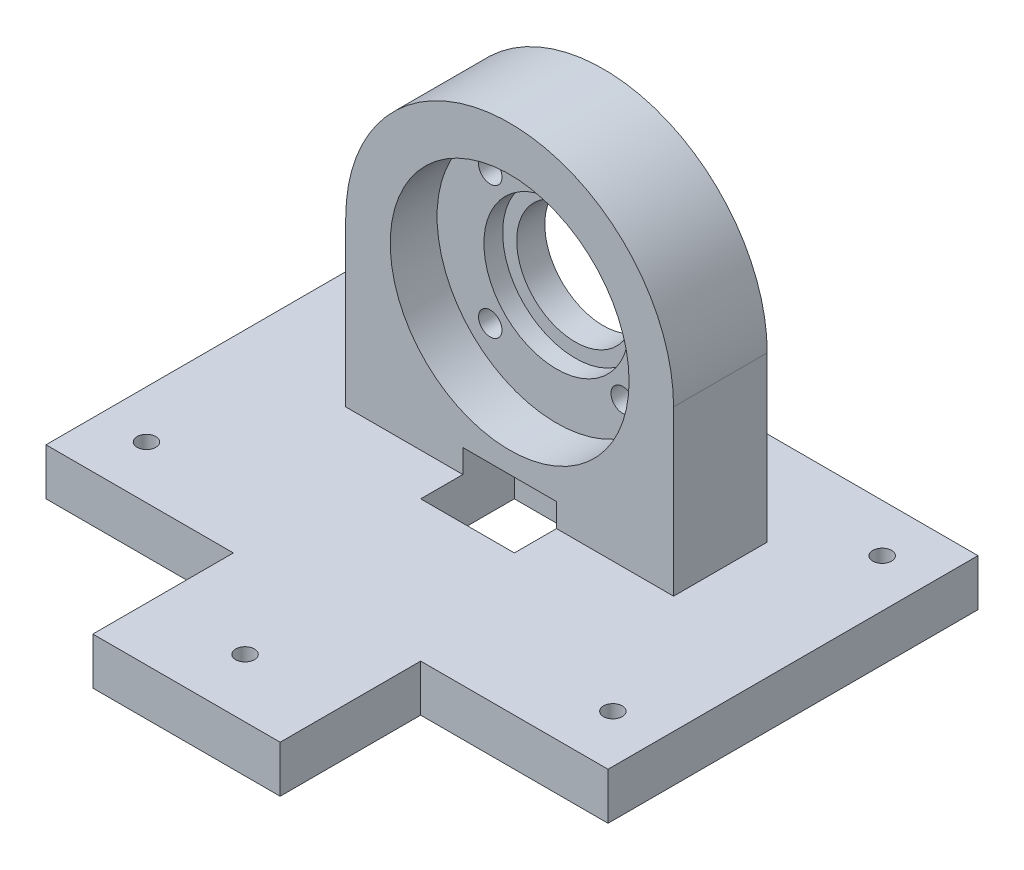
ISO-10303-21;
HEADER;
FILE_DESCRIPTION(('STEP AP214'),'2;1');
FILE_NAME('part.step','',(''),(''),'','','');
FILE_SCHEMA(('AUTOMOTIVE_DESIGN { 1 0 10303 214 1 1 1 1 }'));
ENDSEC;
DATA;
#1=APPLICATION_CONTEXT('core data for automotive mechanical design processes');
#2=APPLICATION_PROTOCOL_DEFINITION('international standard','automotive_design',2000,#1);
#3=PRODUCT_CONTEXT('',#1,'mechanical');
#4=PRODUCT('Part','Part','',(#3));
#5=PRODUCT_RELATED_PRODUCT_CATEGORY('part','',(#4));
#6=PRODUCT_DEFINITION_FORMATION('','',#4);
#7=PRODUCT_DEFINITION_CONTEXT('part definition',#1,'design');
#8=PRODUCT_DEFINITION('design','',#6,#7);
#9=PRODUCT_DEFINITION_SHAPE('','',#8);
#10=(LENGTH_UNIT() NAMED_UNIT(*) SI_UNIT(.MILLI.,.METRE.));
#11=(NAMED_UNIT(*) PLANE_ANGLE_UNIT() SI_UNIT($,.RADIAN.));
#12=(NAMED_UNIT(*) SI_UNIT($,.STERADIAN.) SOLID_ANGLE_UNIT());
#13=UNCERTAINTY_MEASURE_WITH_UNIT(LENGTH_MEASURE(1.E-05),#10,'distance_accuracy_value','');
#14=(GEOMETRIC_REPRESENTATION_CONTEXT(3) GLOBAL_UNCERTAINTY_ASSIGNED_CONTEXT((#13)) GLOBAL_UNIT_ASSIGNED_CONTEXT((#10,
#11,#12)) REPRESENTATION_CONTEXT('',''));
#15=CARTESIAN_POINT('',(0.,0.,0.));
#16=DIRECTION('',(0.,0.,1.));
#17=DIRECTION('',(1.,0.,0.));
#18=AXIS2_PLACEMENT_3D('',#15,#16,#17);
#19=CARTESIAN_POINT('',(-35.,80.,1.));
#20=DIRECTION('',(0.,0.,-1.));
#21=DIRECTION('',(-1.,0.,0.));
#22=AXIS2_PLACEMENT_3D('',#19,#20,#21);
#23=PLANE('',#22);
#24=CARTESIAN_POINT('',(0.,45.,1.));
#25=DIRECTION('',(0.,0.,1.));
#26=DIRECTION('',(1.,0.,0.));
#27=AXIS2_PLACEMENT_3D('',#24,#25,#26);
#28=CIRCLE('',#27,25.5);
#29=CARTESIAN_POINT('',(25.5,45.,1.));
#30=VERTEX_POINT('',#29);
#31=EDGE_CURVE('E260',#30,#30,#28,.T.);
#32=ORIENTED_EDGE('',*,*,#31,.F.);
#33=EDGE_LOOP('',(#32));
#34=FACE_BOUND('',#33,.T.);
#35=DIRECTION('',(1.,0.,0.));
#36=VECTOR('',#35,1.);
#37=CARTESIAN_POINT('',(-35.,15.,1.));
#38=LINE('',#37,#36);
#39=CARTESIAN_POINT('',(-9.99999999999999,15.,1.));
#40=VERTEX_POINT('',#39);
#41=CARTESIAN_POINT('',(10.,15.,1.));
#42=VERTEX_POINT('',#41);
#43=EDGE_CURVE('E12',#40,#42,#38,.T.);
#44=ORIENTED_EDGE('',*,*,#43,.T.);
#45=DIRECTION('',(0.,-1.,0.));
#46=VECTOR('',#45,1.);
#47=CARTESIAN_POINT('',(10.,80.,1.));
#48=LINE('',#47,#46);
#49=CARTESIAN_POINT('',(10.,10.,1.));
#50=VERTEX_POINT('',#49);
#51=EDGE_CURVE('E223',#42,#50,#48,.T.);
#52=ORIENTED_EDGE('',*,*,#51,.T.);
#53=DIRECTION('',(1.,0.,0.));
#54=VECTOR('',#53,1.);
#55=CARTESIAN_POINT('',(-35.,10.,1.));
#56=LINE('',#55,#54);
#57=CARTESIAN_POINT('',(35.,10.,1.));
#58=VERTEX_POINT('',#57);
#59=EDGE_CURVE('E281',#50,#58,#56,.T.);
#60=ORIENTED_EDGE('',*,*,#59,.T.);
#61=DIRECTION('',(0.,-1.,0.));
#62=VECTOR('',#61,1.);
#63=CARTESIAN_POINT('',(35.,80.,1.));
#64=LINE('',#63,#62);
#65=CARTESIAN_POINT('',(35.,45.,0.999999999999997));
#66=VERTEX_POINT('',#65);
#67=EDGE_CURVE('E295',#66,#58,#64,.T.);
#68=ORIENTED_EDGE('',*,*,#67,.F.);
#69=CARTESIAN_POINT('',(0.,45.,0.999999999999997));
#70=DIRECTION('',(0.,0.,-1.));
#71=DIRECTION('',(-1.,0.,0.));
#72=AXIS2_PLACEMENT_3D('',#69,#70,#71);
#73=CIRCLE('',#72,35.);
#74=CARTESIAN_POINT('',(-35.,45.,0.999999999999997));
#75=VERTEX_POINT('',#74);
#76=EDGE_CURVE('E272',#75,#66,#73,.T.);
#77=ORIENTED_EDGE('',*,*,#76,.F.);
#78=DIRECTION('',(0.,-1.,0.));
#79=VECTOR('',#78,1.);
#80=CARTESIAN_POINT('',(-35.,80.,1.));
#81=LINE('',#80,#79);
#82=CARTESIAN_POINT('',(-35.,10.,1.));
#83=VERTEX_POINT('',#82);
#84=EDGE_CURVE('E298',#75,#83,#81,.T.);
#85=ORIENTED_EDGE('',*,*,#84,.T.);
#86=CARTESIAN_POINT('',(-9.99999999999999,10.,1.));
#87=VERTEX_POINT('',#86);
#88=EDGE_CURVE('E282',#83,#87,#56,.T.);
#89=ORIENTED_EDGE('',*,*,#88,.T.);
#90=DIRECTION('',(0.,1.,0.));
#91=VECTOR('',#90,1.);
#92=CARTESIAN_POINT('',(-9.99999999999999,80.,1.));
#93=LINE('',#92,#91);
#94=EDGE_CURVE('E218',#87,#40,#93,.T.);
#95=ORIENTED_EDGE('',*,*,#94,.T.);
#96=EDGE_LOOP('',(#44,#52,#60,#68,#77,#85,#89,#95));
#97=FACE_BOUND('',#96,.T.);
#98=ADVANCED_FACE('F51',(#34,#97),#23,.F.);
#99=CARTESIAN_POINT('',(-35.,80.,-19.));
#100=DIRECTION('',(0.,0.,1.));
#101=DIRECTION('',(1.,0.,0.));
#102=AXIS2_PLACEMENT_3D('',#99,#100,#101);
#103=PLANE('',#102);
#104=CARTESIAN_POINT('',(0.,45.,-19.));
#105=DIRECTION('',(0.,0.,1.));
#106=DIRECTION('',(1.,0.,0.));
#107=AXIS2_PLACEMENT_3D('',#104,#105,#106);
#108=CIRCLE('',#107,12.5);
#109=CARTESIAN_POINT('',(12.5,45.,-19.));
#110=VERTEX_POINT('',#109);
#111=EDGE_CURVE('E229',#110,#110,#108,.F.);
#112=ORIENTED_EDGE('',*,*,#111,.F.);
#113=EDGE_LOOP('',(#112));
#114=FACE_BOUND('',#113,.T.);
#115=CARTESIAN_POINT('',(14.1421356237313,30.857864376269,-19.));
#116=DIRECTION('',(0.,0.,1.));
#117=DIRECTION('',(1.,0.,0.));
#118=AXIS2_PLACEMENT_3D('',#115,#116,#117);
#119=CIRCLE('',#118,2.5);
#120=CARTESIAN_POINT('',(16.6421356237313,30.857864376269,-19.));
#121=VERTEX_POINT('',#120);
#122=EDGE_CURVE('E236',#121,#121,#119,.F.);
#123=ORIENTED_EDGE('',*,*,#122,.F.);
#124=EDGE_LOOP('',(#123));
#125=FACE_BOUND('',#124,.T.);
#126=CARTESIAN_POINT('',(-14.1421356237307,30.8578643762688,-19.));
#127=DIRECTION('',(0.,0.,1.));
#128=DIRECTION('',(1.,0.,0.));
#129=AXIS2_PLACEMENT_3D('',#126,#127,#128);
#130=CIRCLE('',#129,2.5);
#131=CARTESIAN_POINT('',(-11.6421356237307,30.8578643762688,-19.));
#132=VERTEX_POINT('',#131);
#133=EDGE_CURVE('E237',#132,#132,#130,.F.);
#134=ORIENTED_EDGE('',*,*,#133,.F.);
#135=EDGE_LOOP('',(#134));
#136=FACE_BOUND('',#135,.T.);
#137=CARTESIAN_POINT('',(-14.1421356237308,59.1421356237307,-19.));
#138=DIRECTION('',(0.,0.,1.));
#139=DIRECTION('',(1.,0.,0.));
#140=AXIS2_PLACEMENT_3D('',#137,#138,#139);
#141=CIRCLE('',#140,2.5);
#142=CARTESIAN_POINT('',(-11.6421356237308,59.1421356237307,-19.));
#143=VERTEX_POINT('',#142);
#144=EDGE_CURVE('E244',#143,#143,#141,.F.);
#145=ORIENTED_EDGE('',*,*,#144,.F.);
#146=EDGE_LOOP('',(#145));
#147=FACE_BOUND('',#146,.T.);
#148=CARTESIAN_POINT('',(14.142135623731,59.1421356237309,-19.));
#149=DIRECTION('',(0.,0.,1.));
#150=DIRECTION('',(1.,0.,0.));
#151=AXIS2_PLACEMENT_3D('',#148,#149,#150);
#152=CIRCLE('',#151,2.5);
#153=CARTESIAN_POINT('',(16.642135623731,59.1421356237309,-19.));
#154=VERTEX_POINT('',#153);
#155=EDGE_CURVE('E253',#154,#154,#152,.F.);
#156=ORIENTED_EDGE('',*,*,#155,.F.);
#157=EDGE_LOOP('',(#156));
#158=FACE_BOUND('',#157,.T.);
#159=DIRECTION('',(0.,-1.,0.));
#160=VECTOR('',#159,1.);
#161=CARTESIAN_POINT('',(-35.,80.,-19.));
#162=LINE('',#161,#160);
#163=CARTESIAN_POINT('',(-35.,45.,-19.));
#164=VERTEX_POINT('',#163);
#165=CARTESIAN_POINT('',(-35.,10.,-19.));
#166=VERTEX_POINT('',#165);
#167=EDGE_CURVE('E291',#164,#166,#162,.T.);
#168=ORIENTED_EDGE('',*,*,#167,.F.);
#169=CARTESIAN_POINT('',(0.,45.,-19.));
#170=DIRECTION('',(0.,0.,-1.));
#171=DIRECTION('',(-1.,0.,0.));
#172=AXIS2_PLACEMENT_3D('',#169,#170,#171);
#173=CIRCLE('',#172,35.);
#174=CARTESIAN_POINT('',(35.,45.,-19.));
#175=VERTEX_POINT('',#174);
#176=EDGE_CURVE('E271',#164,#175,#173,.T.);
#177=ORIENTED_EDGE('',*,*,#176,.T.);
#178=DIRECTION('',(0.,-1.,0.));
#179=VECTOR('',#178,1.);
#180=CARTESIAN_POINT('',(35.,80.,-19.));
#181=LINE('',#180,#179);
#182=CARTESIAN_POINT('',(35.,10.,-19.));
#183=VERTEX_POINT('',#182);
#184=EDGE_CURVE('E293',#175,#183,#181,.T.);
#185=ORIENTED_EDGE('',*,*,#184,.T.);
#186=DIRECTION('',(-1.,0.,0.));
#187=VECTOR('',#186,1.);
#188=CARTESIAN_POINT('',(-35.,10.,-19.));
#189=LINE('',#188,#187);
#190=EDGE_CURVE('E288',#183,#166,#189,.T.);
#191=ORIENTED_EDGE('',*,*,#190,.T.);
#192=EDGE_LOOP('',(#168,#177,#185,#191));
#193=FACE_BOUND('',#192,.T.);
#194=ADVANCED_FACE('F436',(#114,#125,#136,#147,#158,#193),#103,.F.);
#195=CARTESIAN_POINT('',(35.,80.,1.));
#196=DIRECTION('',(-1.,0.,0.));
#197=DIRECTION('',(0.,0.,1.));
#198=AXIS2_PLACEMENT_3D('',#195,#196,#197);
#199=PLANE('',#198);
#200=DIRECTION('',(0.,0.,-1.));
#201=VECTOR('',#200,1.);
#202=CARTESIAN_POINT('',(35.,45.,0.999999999999997));
#203=LINE('',#202,#201);
#204=EDGE_CURVE('E274',#66,#175,#203,.T.);
#205=ORIENTED_EDGE('',*,*,#204,.F.);
#206=ORIENTED_EDGE('',*,*,#67,.T.);
#207=DIRECTION('',(0.,0.,-1.));
#208=VECTOR('',#207,1.);
#209=CARTESIAN_POINT('',(35.,10.,1.));
#210=LINE('',#209,#208);
#211=EDGE_CURVE('E285',#58,#183,#210,.T.);
#212=ORIENTED_EDGE('',*,*,#211,.T.);
#213=ORIENTED_EDGE('',*,*,#184,.F.);
#214=EDGE_LOOP('',(#205,#206,#212,#213));
#215=FACE_BOUND('',#214,.T.);
#216=ADVANCED_FACE('F442',(#215),#199,.F.);
#217=CARTESIAN_POINT('',(0.,10.,0.));
#218=DIRECTION('',(0.,-1.,0.));
#219=DIRECTION('',(0.,0.,-1.));
#220=AXIS2_PLACEMENT_3D('',#217,#218,#219);
#221=PLANE('',#220);
#222=ORIENTED_EDGE('',*,*,#59,.F.);
#223=DIRECTION('',(0.,0.,1.));
#224=VECTOR('',#223,1.);
#225=CARTESIAN_POINT('',(10.,10.,0.));
#226=LINE('',#225,#224);
#227=CARTESIAN_POINT('',(10.,10.,9.99999999999999));
#228=VERTEX_POINT('',#227);
#229=EDGE_CURVE('E220',#50,#228,#226,.T.);
#230=ORIENTED_EDGE('',*,*,#229,.T.);
#231=DIRECTION('',(-1.,0.,0.));
#232=VECTOR('',#231,1.);
#233=CARTESIAN_POINT('',(0.,10.,9.99999999999999));
#234=LINE('',#233,#232);
#235=CARTESIAN_POINT('',(-9.99999999999999,10.,9.99999999999999));
#236=VERTEX_POINT('',#235);
#237=EDGE_CURVE('E210',#228,#236,#234,.T.);
#238=ORIENTED_EDGE('',*,*,#237,.T.);
#239=DIRECTION('',(0.,0.,-1.));
#240=VECTOR('',#239,1.);
#241=CARTESIAN_POINT('',(-9.99999999999999,10.,0.));
#242=LINE('',#241,#240);
#243=EDGE_CURVE('E215',#236,#87,#242,.T.);
#244=ORIENTED_EDGE('',*,*,#243,.T.);
#245=ORIENTED_EDGE('',*,*,#88,.F.);
#246=DIRECTION('',(0.,0.,1.));
#247=VECTOR('',#246,1.);
#248=CARTESIAN_POINT('',(-35.,10.,-19.));
#249=LINE('',#248,#247);
#250=EDGE_CURVE('E278',#166,#83,#249,.T.);
#251=ORIENTED_EDGE('',*,*,#250,.F.);
#252=ORIENTED_EDGE('',*,*,#190,.F.);
#253=ORIENTED_EDGE('',*,*,#211,.F.);
#254=EDGE_LOOP('',(#222,#230,#238,#244,#245,#251,#252,#253));
#255=FACE_BOUND('',#254,.T.);
#256=CARTESIAN_POINT('',(-49.7964607176049,10.,-28.7500000000006));
#257=DIRECTION('',(0.,1.,0.));
#258=DIRECTION('',(0.,0.,1.));
#259=AXIS2_PLACEMENT_3D('',#256,#257,#258);
#260=CIRCLE('',#259,2.);
#261=CARTESIAN_POINT('',(-49.7964607176049,10.,-26.7500000000006));
#262=VERTEX_POINT('',#261);
#263=EDGE_CURVE('E301',#262,#262,#260,.T.);
#264=ORIENTED_EDGE('',*,*,#263,.F.);
#265=EDGE_LOOP('',(#264));
#266=FACE_BOUND('',#265,.T.);
#267=CARTESIAN_POINT('',(-49.7964607176015,10.,28.7500000000021));
#268=DIRECTION('',(0.,1.,0.));
#269=DIRECTION('',(0.,0.,1.));
#270=AXIS2_PLACEMENT_3D('',#267,#268,#269);
#271=CIRCLE('',#270,2.00000000000465);
#272=CARTESIAN_POINT('',(-49.7964607176015,10.,30.7500000000068));
#273=VERTEX_POINT('',#272);
#274=EDGE_CURVE('E307',#273,#273,#271,.T.);
#275=ORIENTED_EDGE('',*,*,#274,.F.);
#276=EDGE_LOOP('',(#275));
#277=FACE_BOUND('',#276,.T.);
#278=CARTESIAN_POINT('',(4.8886614385545E-12,10.,57.5));
#279=DIRECTION('',(0.,1.,0.));
#280=DIRECTION('',(0.,0.,1.));
#281=AXIS2_PLACEMENT_3D('',#278,#279,#280);
#282=CIRCLE('',#281,2.00000000000506);
#283=CARTESIAN_POINT('',(4.8886614385545E-12,10.,59.5000000000051));
#284=VERTEX_POINT('',#283);
#285=EDGE_CURVE('E313',#284,#284,#282,.T.);
#286=ORIENTED_EDGE('',*,*,#285,.F.);
#287=EDGE_LOOP('',(#286));
#288=FACE_BOUND('',#287,.T.);
#289=CARTESIAN_POINT('',(49.7964607176089,10.,28.7499999999979));
#290=DIRECTION('',(0.,1.,0.));
#291=DIRECTION('',(0.,0.,1.));
#292=AXIS2_PLACEMENT_3D('',#289,#290,#291);
#293=CIRCLE('',#292,2.00000000000315);
#294=CARTESIAN_POINT('',(49.7964607176089,10.,30.750000000001));
#295=VERTEX_POINT('',#294);
#296=EDGE_CURVE('E319',#295,#295,#293,.T.);
#297=ORIENTED_EDGE('',*,*,#296,.F.);
#298=EDGE_LOOP('',(#297));
#299=FACE_BOUND('',#298,.T.);
#300=CARTESIAN_POINT('',(49.7964607176053,10.,-28.7499999999999));
#301=DIRECTION('',(0.,1.,0.));
#302=DIRECTION('',(0.,0.,1.));
#303=AXIS2_PLACEMENT_3D('',#300,#301,#302);
#304=CIRCLE('',#303,2.);
#305=CARTESIAN_POINT('',(49.7964607176053,10.,-26.7499999999999));
#306=VERTEX_POINT('',#305);
#307=EDGE_CURVE('E325',#306,#306,#304,.T.);
#308=ORIENTED_EDGE('',*,*,#307,.F.);
#309=EDGE_LOOP('',(#308));
#310=FACE_BOUND('',#309,.T.);
#311=DIRECTION('',(0.,0.,1.));
#312=VECTOR('',#311,1.);
#313=CARTESIAN_POINT('',(-60.,10.,40.));
#314=LINE('',#313,#312);
#315=CARTESIAN_POINT('',(-60.,10.,-39.));
#316=VERTEX_POINT('',#315);
#317=CARTESIAN_POINT('',(-60.,10.,40.));
#318=VERTEX_POINT('',#317);
#319=EDGE_CURVE('E331',#316,#318,#314,.T.);
#320=ORIENTED_EDGE('',*,*,#319,.T.);
#321=DIRECTION('',(1.,0.,0.));
#322=VECTOR('',#321,1.);
#323=CARTESIAN_POINT('',(-35.,10.,40.));
#324=LINE('',#323,#322);
#325=CARTESIAN_POINT('',(-20.,10.,40.));
#326=VERTEX_POINT('',#325);
#327=EDGE_CURVE('E334',#318,#326,#324,.T.);
#328=ORIENTED_EDGE('',*,*,#327,.T.);
#329=DIRECTION('',(0.,0.,1.));
#330=VECTOR('',#329,1.);
#331=CARTESIAN_POINT('',(-20.,10.,40.));
#332=LINE('',#331,#330);
#333=CARTESIAN_POINT('',(-20.,10.,70.));
#334=VERTEX_POINT('',#333);
#335=EDGE_CURVE('E337',#326,#334,#332,.T.);
#336=ORIENTED_EDGE('',*,*,#335,.T.);
#337=DIRECTION('',(1.,0.,0.));
#338=VECTOR('',#337,1.);
#339=CARTESIAN_POINT('',(-20.,10.,70.));
#340=LINE('',#339,#338);
#341=CARTESIAN_POINT('',(20.,10.,70.));
#342=VERTEX_POINT('',#341);
#343=EDGE_CURVE('E339',#334,#342,#340,.T.);
#344=ORIENTED_EDGE('',*,*,#343,.T.);
#345=DIRECTION('',(0.,0.,-1.));
#346=VECTOR('',#345,1.);
#347=CARTESIAN_POINT('',(20.,10.,40.));
#348=LINE('',#347,#346);
#349=CARTESIAN_POINT('',(20.,10.,40.));
#350=VERTEX_POINT('',#349);
#351=EDGE_CURVE('E341',#342,#350,#348,.T.);
#352=ORIENTED_EDGE('',*,*,#351,.T.);
#353=DIRECTION('',(1.,0.,0.));
#354=VECTOR('',#353,1.);
#355=CARTESIAN_POINT('',(35.,10.,40.));
#356=LINE('',#355,#354);
#357=CARTESIAN_POINT('',(60.,10.,40.));
#358=VERTEX_POINT('',#357);
#359=EDGE_CURVE('E343',#350,#358,#356,.T.);
#360=ORIENTED_EDGE('',*,*,#359,.T.);
#361=DIRECTION('',(0.,0.,-1.));
#362=VECTOR('',#361,1.);
#363=CARTESIAN_POINT('',(60.,10.,-39.));
#364=LINE('',#363,#362);
#365=CARTESIAN_POINT('',(60.,10.,-39.));
#366=VERTEX_POINT('',#365);
#367=EDGE_CURVE('E345',#358,#366,#364,.T.);
#368=ORIENTED_EDGE('',*,*,#367,.T.);
#369=DIRECTION('',(-1.,0.,0.));
#370=VECTOR('',#369,1.);
#371=CARTESIAN_POINT('',(-60.,10.,-39.));
#372=LINE('',#371,#370);
#373=EDGE_CURVE('E347',#366,#316,#372,.T.);
#374=ORIENTED_EDGE('',*,*,#373,.T.);
#375=EDGE_LOOP('',(#320,#328,#336,#344,#352,#360,#368,#374));
#376=FACE_BOUND('',#375,.T.);
#377=ADVANCED_FACE('F412',(#255,#266,#277,#288,#299,#310,#376),#221,.F.);
#378=CARTESIAN_POINT('',(0.,0.,0.));
#379=DIRECTION('',(0.,-1.,0.));
#380=DIRECTION('',(0.,0.,-1.));
#381=AXIS2_PLACEMENT_3D('',#378,#379,#380);
#382=PLANE('',#381);
#383=DIRECTION('',(0.,0.,1.));
#384=VECTOR('',#383,1.);
#385=CARTESIAN_POINT('',(10.,0.,-10.));
#386=LINE('',#385,#384);
#387=CARTESIAN_POINT('',(10.,0.,-10.));
#388=VERTEX_POINT('',#387);
#389=CARTESIAN_POINT('',(10.,0.,9.99999999999999));
#390=VERTEX_POINT('',#389);
#391=EDGE_CURVE('E74',#388,#390,#386,.T.);
#392=ORIENTED_EDGE('',*,*,#391,.F.);
#393=DIRECTION('',(1.,0.,0.));
#394=VECTOR('',#393,1.);
#395=CARTESIAN_POINT('',(-9.99999999999999,0.,-10.));
#396=LINE('',#395,#394);
#397=CARTESIAN_POINT('',(-9.99999999999999,0.,-10.));
#398=VERTEX_POINT('',#397);
#399=EDGE_CURVE('E208',#398,#388,#396,.T.);
#400=ORIENTED_EDGE('',*,*,#399,.F.);
#401=DIRECTION('',(0.,0.,-1.));
#402=VECTOR('',#401,1.);
#403=CARTESIAN_POINT('',(-9.99999999999999,0.,-10.));
#404=LINE('',#403,#402);
#405=CARTESIAN_POINT('',(-9.99999999999999,0.,9.99999999999999));
#406=VERTEX_POINT('',#405);
#407=EDGE_CURVE('E191',#406,#398,#404,.T.);
#408=ORIENTED_EDGE('',*,*,#407,.F.);
#409=DIRECTION('',(-1.,0.,0.));
#410=VECTOR('',#409,1.);
#411=CARTESIAN_POINT('',(-9.99999999999999,0.,9.99999999999999));
#412=LINE('',#411,#410);
#413=EDGE_CURVE('E205',#390,#406,#412,.T.);
#414=ORIENTED_EDGE('',*,*,#413,.F.);
#415=EDGE_LOOP('',(#392,#400,#408,#414));
#416=FACE_BOUND('',#415,.T.);
#417=CARTESIAN_POINT('',(-49.7964607176015,0.,28.7500000000021));
#418=DIRECTION('',(0.,1.,0.));
#419=DIRECTION('',(0.,0.,1.));
#420=AXIS2_PLACEMENT_3D('',#417,#418,#419);
#421=CIRCLE('',#420,2.00000000000465);
#422=CARTESIAN_POINT('',(-49.7964607176015,0.,30.7500000000068));
#423=VERTEX_POINT('',#422);
#424=EDGE_CURVE('E304',#423,#423,#421,.T.);
#425=ORIENTED_EDGE('',*,*,#424,.T.);
#426=EDGE_LOOP('',(#425));
#427=FACE_BOUND('',#426,.T.);
#428=CARTESIAN_POINT('',(49.7964607176089,0.,28.7499999999979));
#429=DIRECTION('',(0.,1.,0.));
#430=DIRECTION('',(0.,0.,1.));
#431=AXIS2_PLACEMENT_3D('',#428,#429,#430);
#432=CIRCLE('',#431,2.00000000000315);
#433=CARTESIAN_POINT('',(49.7964607176089,0.,30.750000000001));
#434=VERTEX_POINT('',#433);
#435=EDGE_CURVE('E316',#434,#434,#432,.T.);
#436=ORIENTED_EDGE('',*,*,#435,.T.);
#437=EDGE_LOOP('',(#436));
#438=FACE_BOUND('',#437,.T.);
#439=DIRECTION('',(0.,0.,1.));
#440=VECTOR('',#439,1.);
#441=CARTESIAN_POINT('',(-60.,0.,40.));
#442=LINE('',#441,#440);
#443=CARTESIAN_POINT('',(-60.,0.,-39.));
#444=VERTEX_POINT('',#443);
#445=CARTESIAN_POINT('',(-60.,0.,40.));
#446=VERTEX_POINT('',#445);
#447=EDGE_CURVE('E328',#444,#446,#442,.T.);
#448=ORIENTED_EDGE('',*,*,#447,.F.);
#449=DIRECTION('',(-1.,0.,0.));
#450=VECTOR('',#449,1.);
#451=CARTESIAN_POINT('',(-60.,0.,-39.));
#452=LINE('',#451,#450);
#453=CARTESIAN_POINT('',(60.,0.,-39.));
#454=VERTEX_POINT('',#453);
#455=EDGE_CURVE('E335',#454,#444,#452,.T.);
#456=ORIENTED_EDGE('',*,*,#455,.F.);
#457=DIRECTION('',(0.,0.,-1.));
#458=VECTOR('',#457,1.);
#459=CARTESIAN_POINT('',(60.,0.,-39.));
#460=LINE('',#459,#458);
#461=CARTESIAN_POINT('',(60.,0.,40.));
#462=VERTEX_POINT('',#461);
#463=EDGE_CURVE('E363',#462,#454,#460,.T.);
#464=ORIENTED_EDGE('',*,*,#463,.F.);
#465=DIRECTION('',(1.,0.,0.));
#466=VECTOR('',#465,1.);
#467=CARTESIAN_POINT('',(60.,0.,40.));
#468=LINE('',#467,#466);
#469=CARTESIAN_POINT('',(20.,0.,40.));
#470=VERTEX_POINT('',#469);
#471=EDGE_CURVE('E361',#470,#462,#468,.T.);
#472=ORIENTED_EDGE('',*,*,#471,.F.);
#473=DIRECTION('',(0.,0.,-1.));
#474=VECTOR('',#473,1.);
#475=CARTESIAN_POINT('',(20.,0.,40.));
#476=LINE('',#475,#474);
#477=CARTESIAN_POINT('',(20.,0.,70.));
#478=VERTEX_POINT('',#477);
#479=EDGE_CURVE('E358',#478,#470,#476,.T.);
#480=ORIENTED_EDGE('',*,*,#479,.F.);
#481=DIRECTION('',(1.,0.,0.));
#482=VECTOR('',#481,1.);
#483=CARTESIAN_POINT('',(-20.,0.,70.));
#484=LINE('',#483,#482);
#485=CARTESIAN_POINT('',(-20.,0.,70.));
#486=VERTEX_POINT('',#485);
#487=EDGE_CURVE('E356',#486,#478,#484,.T.);
#488=ORIENTED_EDGE('',*,*,#487,.F.);
#489=DIRECTION('',(0.,0.,1.));
#490=VECTOR('',#489,1.);
#491=CARTESIAN_POINT('',(-20.,0.,40.));
#492=LINE('',#491,#490);
#493=CARTESIAN_POINT('',(-20.,0.,40.));
#494=VERTEX_POINT('',#493);
#495=EDGE_CURVE('E354',#494,#486,#492,.T.);
#496=ORIENTED_EDGE('',*,*,#495,.F.);
#497=DIRECTION('',(1.,0.,0.));
#498=VECTOR('',#497,1.);
#499=CARTESIAN_POINT('',(-35.,0.,40.));
#500=LINE('',#499,#498);
#501=EDGE_CURVE('E352',#446,#494,#500,.T.);
#502=ORIENTED_EDGE('',*,*,#501,.F.);
#503=EDGE_LOOP('',(#448,#456,#464,#472,#480,#488,#496,#502));
#504=FACE_BOUND('',#503,.T.);
#505=CARTESIAN_POINT('',(49.7964607176053,0.,-28.7499999999999));
#506=DIRECTION('',(0.,1.,0.));
#507=DIRECTION('',(0.,0.,1.));
#508=AXIS2_PLACEMENT_3D('',#505,#506,#507);
#509=CIRCLE('',#508,2.);
#510=CARTESIAN_POINT('',(49.7964607176053,0.,-26.7499999999999));
#511=VERTEX_POINT('',#510);
#512=EDGE_CURVE('E322',#511,#511,#509,.T.);
#513=ORIENTED_EDGE('',*,*,#512,.T.);
#514=EDGE_LOOP('',(#513));
#515=FACE_BOUND('',#514,.T.);
#516=CARTESIAN_POINT('',(4.8886614385545E-12,0.,57.5));
#517=DIRECTION('',(0.,1.,0.));
#518=DIRECTION('',(0.,0.,1.));
#519=AXIS2_PLACEMENT_3D('',#516,#517,#518);
#520=CIRCLE('',#519,2.00000000000506);
#521=CARTESIAN_POINT('',(4.8886614385545E-12,0.,59.5000000000051));
#522=VERTEX_POINT('',#521);
#523=EDGE_CURVE('E310',#522,#522,#520,.T.);
#524=ORIENTED_EDGE('',*,*,#523,.T.);
#525=EDGE_LOOP('',(#524));
#526=FACE_BOUND('',#525,.T.);
#527=CARTESIAN_POINT('',(-49.7964607176049,0.,-28.7500000000006));
#528=DIRECTION('',(0.,1.,0.));
#529=DIRECTION('',(0.,0.,1.));
#530=AXIS2_PLACEMENT_3D('',#527,#528,#529);
#531=CIRCLE('',#530,2.);
#532=CARTESIAN_POINT('',(-49.7964607176049,0.,-26.7500000000006));
#533=VERTEX_POINT('',#532);
#534=EDGE_CURVE('E300',#533,#533,#531,.T.);
#535=ORIENTED_EDGE('',*,*,#534,.T.);
#536=EDGE_LOOP('',(#535));
#537=FACE_BOUND('',#536,.T.);
#538=ADVANCED_FACE('F396',(#416,#427,#438,#504,#515,#526,#537),#382,.T.);
#539=CARTESIAN_POINT('',(-60.,10.,40.));
#540=DIRECTION('',(1.,0.,0.));
#541=DIRECTION('',(0.,0.,-1.));
#542=AXIS2_PLACEMENT_3D('',#539,#540,#541);
#543=PLANE('',#542);
#544=ORIENTED_EDGE('',*,*,#447,.T.);
#545=DIRECTION('',(0.,-1.,0.));
#546=VECTOR('',#545,1.);
#547=CARTESIAN_POINT('',(-60.,10.,40.));
#548=LINE('',#547,#546);
#549=EDGE_CURVE('E59',#318,#446,#548,.T.);
#550=ORIENTED_EDGE('',*,*,#549,.F.);
#551=ORIENTED_EDGE('',*,*,#319,.F.);
#552=DIRECTION('',(0.,-1.,0.));
#553=VECTOR('',#552,1.);
#554=CARTESIAN_POINT('',(-60.,10.,-39.));
#555=LINE('',#554,#553);
#556=EDGE_CURVE('E349',#316,#444,#555,.T.);
#557=ORIENTED_EDGE('',*,*,#556,.T.);
#558=EDGE_LOOP('',(#544,#550,#551,#557));
#559=FACE_BOUND('',#558,.T.);
#560=ADVANCED_FACE('F53',(#559),#543,.F.);
#561=CARTESIAN_POINT('',(-35.,10.,40.));
#562=DIRECTION('',(0.,0.,-1.));
#563=DIRECTION('',(-1.,0.,0.));
#564=AXIS2_PLACEMENT_3D('',#561,#562,#563);
#565=PLANE('',#564);
#566=ORIENTED_EDGE('',*,*,#501,.T.);
#567=DIRECTION('',(0.,-1.,0.));
#568=VECTOR('',#567,1.);
#569=CARTESIAN_POINT('',(-20.,10.,40.));
#570=LINE('',#569,#568);
#571=EDGE_CURVE('E383',#326,#494,#570,.T.);
#572=ORIENTED_EDGE('',*,*,#571,.F.);
#573=ORIENTED_EDGE('',*,*,#327,.F.);
#574=ORIENTED_EDGE('',*,*,#549,.T.);
#575=EDGE_LOOP('',(#566,#572,#573,#574));
#576=FACE_BOUND('',#575,.T.);
#577=ADVANCED_FACE('F388',(#576),#565,.F.);
#578=CARTESIAN_POINT('',(-20.,10.,40.));
#579=DIRECTION('',(1.,0.,0.));
#580=DIRECTION('',(0.,0.,-1.));
#581=AXIS2_PLACEMENT_3D('',#578,#579,#580);
#582=PLANE('',#581);
#583=ORIENTED_EDGE('',*,*,#495,.T.);
#584=DIRECTION('',(0.,-1.,0.));
#585=VECTOR('',#584,1.);
#586=CARTESIAN_POINT('',(-20.,10.,70.));
#587=LINE('',#586,#585);
#588=EDGE_CURVE('E380',#334,#486,#587,.T.);
#589=ORIENTED_EDGE('',*,*,#588,.F.);
#590=ORIENTED_EDGE('',*,*,#335,.F.);
#591=ORIENTED_EDGE('',*,*,#571,.T.);
#592=EDGE_LOOP('',(#583,#589,#590,#591));
#593=FACE_BOUND('',#592,.T.);
#594=ADVANCED_FACE('F404',(#593),#582,.F.);
#595=CARTESIAN_POINT('',(-20.,10.,70.));
#596=DIRECTION('',(0.,0.,-1.));
#597=DIRECTION('',(-1.,0.,0.));
#598=AXIS2_PLACEMENT_3D('',#595,#596,#597);
#599=PLANE('',#598);
#600=ORIENTED_EDGE('',*,*,#487,.T.);
#601=DIRECTION('',(0.,-1.,0.));
#602=VECTOR('',#601,1.);
#603=CARTESIAN_POINT('',(20.,10.,70.));
#604=LINE('',#603,#602);
#605=EDGE_CURVE('E377',#342,#478,#604,.T.);
#606=ORIENTED_EDGE('',*,*,#605,.F.);
#607=ORIENTED_EDGE('',*,*,#343,.F.);
#608=ORIENTED_EDGE('',*,*,#588,.T.);
#609=EDGE_LOOP('',(#600,#606,#607,#608));
#610=FACE_BOUND('',#609,.T.);
#611=ADVANCED_FACE('F408',(#610),#599,.F.);
#612=CARTESIAN_POINT('',(20.,10.,40.));
#613=DIRECTION('',(-1.,0.,0.));
#614=DIRECTION('',(0.,0.,1.));
#615=AXIS2_PLACEMENT_3D('',#612,#613,#614);
#616=PLANE('',#615);
#617=ORIENTED_EDGE('',*,*,#479,.T.);
#618=DIRECTION('',(0.,-1.,0.));
#619=VECTOR('',#618,1.);
#620=CARTESIAN_POINT('',(20.,10.,40.));
#621=LINE('',#620,#619);
#622=EDGE_CURVE('E374',#350,#470,#621,.T.);
#623=ORIENTED_EDGE('',*,*,#622,.F.);
#624=ORIENTED_EDGE('',*,*,#351,.F.);
#625=ORIENTED_EDGE('',*,*,#605,.T.);
#626=EDGE_LOOP('',(#617,#623,#624,#625));
#627=FACE_BOUND('',#626,.T.);
#628=ADVANCED_FACE('F424',(#627),#616,.F.);
#629=CARTESIAN_POINT('',(60.,10.,40.));
#630=DIRECTION('',(0.,0.,-1.));
#631=DIRECTION('',(-1.,0.,0.));
#632=AXIS2_PLACEMENT_3D('',#629,#630,#631);
#633=PLANE('',#632);
#634=ORIENTED_EDGE('',*,*,#471,.T.);
#635=DIRECTION('',(0.,-1.,0.));
#636=VECTOR('',#635,1.);
#637=CARTESIAN_POINT('',(60.,10.,40.));
#638=LINE('',#637,#636);
#639=EDGE_CURVE('E371',#358,#462,#638,.T.);
#640=ORIENTED_EDGE('',*,*,#639,.F.);
#641=ORIENTED_EDGE('',*,*,#359,.F.);
#642=ORIENTED_EDGE('',*,*,#622,.T.);
#643=EDGE_LOOP('',(#634,#640,#641,#642));
#644=FACE_BOUND('',#643,.T.);
#645=ADVANCED_FACE('F426',(#644),#633,.F.);
#646=CARTESIAN_POINT('',(60.,10.,-39.));
#647=DIRECTION('',(-1.,0.,0.));
#648=DIRECTION('',(0.,0.,1.));
#649=AXIS2_PLACEMENT_3D('',#646,#647,#648);
#650=PLANE('',#649);
#651=ORIENTED_EDGE('',*,*,#463,.T.);
#652=DIRECTION('',(0.,-1.,0.));
#653=VECTOR('',#652,1.);
#654=CARTESIAN_POINT('',(60.,10.,-39.));
#655=LINE('',#654,#653);
#656=EDGE_CURVE('E368',#366,#454,#655,.T.);
#657=ORIENTED_EDGE('',*,*,#656,.F.);
#658=ORIENTED_EDGE('',*,*,#367,.F.);
#659=ORIENTED_EDGE('',*,*,#639,.T.);
#660=EDGE_LOOP('',(#651,#657,#658,#659));
#661=FACE_BOUND('',#660,.T.);
#662=ADVANCED_FACE('F420',(#661),#650,.F.);
#663=CARTESIAN_POINT('',(-60.,10.,-39.));
#664=DIRECTION('',(0.,0.,1.));
#665=DIRECTION('',(1.,0.,0.));
#666=AXIS2_PLACEMENT_3D('',#663,#664,#665);
#667=PLANE('',#666);
#668=ORIENTED_EDGE('',*,*,#455,.T.);
#669=ORIENTED_EDGE('',*,*,#556,.F.);
#670=ORIENTED_EDGE('',*,*,#373,.F.);
#671=ORIENTED_EDGE('',*,*,#656,.T.);
#672=EDGE_LOOP('',(#668,#669,#670,#671));
#673=FACE_BOUND('',#672,.T.);
#674=ADVANCED_FACE('F418',(#673),#667,.F.);
#675=CARTESIAN_POINT('',(49.7964607176053,10.,-28.7499999999999));
#676=DIRECTION('',(0.,-1.,0.));
#677=DIRECTION('',(0.,0.,-1.));
#678=AXIS2_PLACEMENT_3D('',#675,#676,#677);
#679=CYLINDRICAL_SURFACE('',#678,2.);
#680=ORIENTED_EDGE('',*,*,#307,.T.);
#681=EDGE_LOOP('',(#680));
#682=FACE_BOUND('',#681,.T.);
#683=ORIENTED_EDGE('',*,*,#512,.F.);
#684=EDGE_LOOP('',(#683));
#685=FACE_BOUND('',#684,.T.);
#686=ADVANCED_FACE('F469',(#682,#685),#679,.F.);
#687=CARTESIAN_POINT('',(49.7964607176089,10.,28.7499999999979));
#688=DIRECTION('',(0.,-1.,0.));
#689=DIRECTION('',(0.,0.,-1.));
#690=AXIS2_PLACEMENT_3D('',#687,#688,#689);
#691=CYLINDRICAL_SURFACE('',#690,2.00000000000315);
#692=ORIENTED_EDGE('',*,*,#296,.T.);
#693=EDGE_LOOP('',(#692));
#694=FACE_BOUND('',#693,.T.);
#695=ORIENTED_EDGE('',*,*,#435,.F.);
#696=EDGE_LOOP('',(#695));
#697=FACE_BOUND('',#696,.T.);
#698=ADVANCED_FACE('F465',(#694,#697),#691,.F.);
#699=CARTESIAN_POINT('',(4.8886614385545E-12,10.,57.5));
#700=DIRECTION('',(0.,-1.,0.));
#701=DIRECTION('',(0.,0.,-1.));
#702=AXIS2_PLACEMENT_3D('',#699,#700,#701);
#703=CYLINDRICAL_SURFACE('',#702,2.00000000000506);
#704=ORIENTED_EDGE('',*,*,#285,.T.);
#705=EDGE_LOOP('',(#704));
#706=FACE_BOUND('',#705,.T.);
#707=ORIENTED_EDGE('',*,*,#523,.F.);
#708=EDGE_LOOP('',(#707));
#709=FACE_BOUND('',#708,.T.);
#710=ADVANCED_FACE('F461',(#706,#709),#703,.F.);
#711=CARTESIAN_POINT('',(-49.7964607176015,10.,28.7500000000021));
#712=DIRECTION('',(0.,-1.,0.));
#713=DIRECTION('',(0.,0.,-1.));
#714=AXIS2_PLACEMENT_3D('',#711,#712,#713);
#715=CYLINDRICAL_SURFACE('',#714,2.00000000000465);
#716=ORIENTED_EDGE('',*,*,#274,.T.);
#717=EDGE_LOOP('',(#716));
#718=FACE_BOUND('',#717,.T.);
#719=ORIENTED_EDGE('',*,*,#424,.F.);
#720=EDGE_LOOP('',(#719));
#721=FACE_BOUND('',#720,.T.);
#722=ADVANCED_FACE('F457',(#718,#721),#715,.F.);
#723=CARTESIAN_POINT('',(-49.7964607176049,10.,-28.7500000000006));
#724=DIRECTION('',(0.,-1.,0.));
#725=DIRECTION('',(0.,0.,-1.));
#726=AXIS2_PLACEMENT_3D('',#723,#724,#725);
#727=CYLINDRICAL_SURFACE('',#726,2.);
#728=ORIENTED_EDGE('',*,*,#263,.T.);
#729=EDGE_LOOP('',(#728));
#730=FACE_BOUND('',#729,.T.);
#731=ORIENTED_EDGE('',*,*,#534,.F.);
#732=EDGE_LOOP('',(#731));
#733=FACE_BOUND('',#732,.T.);
#734=ADVANCED_FACE('F453',(#730,#733),#727,.F.);
#735=CARTESIAN_POINT('',(-35.,80.,-19.));
#736=DIRECTION('',(1.,0.,0.));
#737=DIRECTION('',(0.,0.,-1.));
#738=AXIS2_PLACEMENT_3D('',#735,#736,#737);
#739=PLANE('',#738);
#740=ORIENTED_EDGE('',*,*,#84,.F.);
#741=DIRECTION('',(0.,0.,-1.));
#742=VECTOR('',#741,1.);
#743=CARTESIAN_POINT('',(-35.,45.,0.999999999999997));
#744=LINE('',#743,#742);
#745=EDGE_CURVE('E266',#75,#164,#744,.T.);
#746=ORIENTED_EDGE('',*,*,#745,.T.);
#747=ORIENTED_EDGE('',*,*,#167,.T.);
#748=ORIENTED_EDGE('',*,*,#250,.T.);
#749=EDGE_LOOP('',(#740,#746,#747,#748));
#750=FACE_BOUND('',#749,.T.);
#751=ADVANCED_FACE('F449',(#750),#739,.F.);
#752=CARTESIAN_POINT('',(0.,45.,0.999999999999997));
#753=DIRECTION('',(0.,0.,-1.));
#754=DIRECTION('',(-1.,0.,0.));
#755=AXIS2_PLACEMENT_3D('',#752,#753,#754);
#756=CYLINDRICAL_SURFACE('',#755,35.);
#757=ORIENTED_EDGE('',*,*,#176,.F.);
#758=ORIENTED_EDGE('',*,*,#745,.F.);
#759=ORIENTED_EDGE('',*,*,#76,.T.);
#760=ORIENTED_EDGE('',*,*,#204,.T.);
#761=EDGE_LOOP('',(#757,#758,#759,#760));
#762=FACE_BOUND('',#761,.T.);
#763=ADVANCED_FACE('F452',(#762),#756,.T.);
#764=CARTESIAN_POINT('',(0.,45.,-9.));
#765=DIRECTION('',(0.,0.,1.));
#766=DIRECTION('',(1.,0.,0.));
#767=AXIS2_PLACEMENT_3D('',#764,#765,#766);
#768=CYLINDRICAL_SURFACE('',#767,25.5);
#769=CARTESIAN_POINT('',(0.,45.,-9.));
#770=DIRECTION('',(0.,0.,1.));
#771=DIRECTION('',(1.,0.,0.));
#772=AXIS2_PLACEMENT_3D('',#769,#770,#771);
#773=CIRCLE('',#772,25.5);
#774=CARTESIAN_POINT('',(25.5,45.,-9.));
#775=VERTEX_POINT('',#774);
#776=EDGE_CURVE('E263',#775,#775,#773,.T.);
#777=ORIENTED_EDGE('',*,*,#776,.F.);
#778=EDGE_LOOP('',(#777));
#779=FACE_BOUND('',#778,.T.);
#780=ORIENTED_EDGE('',*,*,#31,.T.);
#781=EDGE_LOOP('',(#780));
#782=FACE_BOUND('',#781,.T.);
#783=ADVANCED_FACE('F516',(#779,#782),#768,.F.);
#784=CARTESIAN_POINT('',(0.,45.,-9.));
#785=DIRECTION('',(0.,0.,1.));
#786=DIRECTION('',(1.,0.,0.));
#787=AXIS2_PLACEMENT_3D('',#784,#785,#786);
#788=PLANE('',#787);
#789=CARTESIAN_POINT('',(14.1421356237313,30.857864376269,-9.));
#790=DIRECTION('',(0.,0.,1.));
#791=DIRECTION('',(1.,0.,0.));
#792=AXIS2_PLACEMENT_3D('',#789,#790,#791);
#793=CIRCLE('',#792,2.5);
#794=CARTESIAN_POINT('',(16.6421356237313,30.857864376269,-9.));
#795=VERTEX_POINT('',#794);
#796=EDGE_CURVE('E233',#795,#795,#793,.T.);
#797=ORIENTED_EDGE('',*,*,#796,.F.);
#798=EDGE_LOOP('',(#797));
#799=FACE_BOUND('',#798,.T.);
#800=CARTESIAN_POINT('',(-14.1421356237307,30.8578643762688,-9.));
#801=DIRECTION('',(0.,0.,1.));
#802=DIRECTION('',(1.,0.,0.));
#803=AXIS2_PLACEMENT_3D('',#800,#801,#802);
#804=CIRCLE('',#803,2.5);
#805=CARTESIAN_POINT('',(-11.6421356237307,30.8578643762688,-9.));
#806=VERTEX_POINT('',#805);
#807=EDGE_CURVE('E241',#806,#806,#804,.T.);
#808=ORIENTED_EDGE('',*,*,#807,.F.);
#809=EDGE_LOOP('',(#808));
#810=FACE_BOUND('',#809,.T.);
#811=CARTESIAN_POINT('',(-14.1421356237308,59.1421356237307,-9.));
#812=DIRECTION('',(0.,0.,1.));
#813=DIRECTION('',(1.,0.,0.));
#814=AXIS2_PLACEMENT_3D('',#811,#812,#813);
#815=CIRCLE('',#814,2.5);
#816=CARTESIAN_POINT('',(-11.6421356237308,59.1421356237307,-9.));
#817=VERTEX_POINT('',#816);
#818=EDGE_CURVE('E232',#817,#817,#815,.T.);
#819=ORIENTED_EDGE('',*,*,#818,.F.);
#820=EDGE_LOOP('',(#819));
#821=FACE_BOUND('',#820,.T.);
#822=CARTESIAN_POINT('',(14.142135623731,59.1421356237309,-9.));
#823=DIRECTION('',(0.,0.,1.));
#824=DIRECTION('',(1.,0.,0.));
#825=AXIS2_PLACEMENT_3D('',#822,#823,#824);
#826=CIRCLE('',#825,2.5);
#827=CARTESIAN_POINT('',(16.642135623731,59.1421356237309,-9.));
#828=VERTEX_POINT('',#827);
#829=EDGE_CURVE('E240',#828,#828,#826,.T.);
#830=ORIENTED_EDGE('',*,*,#829,.F.);
#831=EDGE_LOOP('',(#830));
#832=FACE_BOUND('',#831,.T.);
#833=CARTESIAN_POINT('',(0.,45.,-9.));
#834=DIRECTION('',(0.,0.,1.));
#835=DIRECTION('',(1.,0.,0.));
#836=AXIS2_PLACEMENT_3D('',#833,#834,#835);
#837=CIRCLE('',#836,15.5);
#838=CARTESIAN_POINT('',(15.5,45.,-9.));
#839=VERTEX_POINT('',#838);
#840=EDGE_CURVE('E256',#839,#839,#837,.T.);
#841=ORIENTED_EDGE('',*,*,#840,.F.);
#842=EDGE_LOOP('',(#841));
#843=FACE_BOUND('',#842,.T.);
#844=ORIENTED_EDGE('',*,*,#776,.T.);
#845=EDGE_LOOP('',(#844));
#846=FACE_BOUND('',#845,.T.);
#847=ADVANCED_FACE('F524',(#799,#810,#821,#832,#843,#846),#788,.T.);
#848=CARTESIAN_POINT('',(0.,45.,-13.));
#849=DIRECTION('',(0.,0.,1.));
#850=DIRECTION('',(1.,0.,0.));
#851=AXIS2_PLACEMENT_3D('',#848,#849,#850);
#852=CYLINDRICAL_SURFACE('',#851,15.5);
#853=CARTESIAN_POINT('',(0.,45.,-13.));
#854=DIRECTION('',(0.,0.,1.));
#855=DIRECTION('',(1.,0.,0.));
#856=AXIS2_PLACEMENT_3D('',#853,#854,#855);
#857=CIRCLE('',#856,15.5);
#858=CARTESIAN_POINT('',(15.5,45.,-13.));
#859=VERTEX_POINT('',#858);
#860=EDGE_CURVE('E257',#859,#859,#857,.T.);
#861=ORIENTED_EDGE('',*,*,#860,.F.);
#862=EDGE_LOOP('',(#861));
#863=FACE_BOUND('',#862,.T.);
#864=ORIENTED_EDGE('',*,*,#840,.T.);
#865=EDGE_LOOP('',(#864));
#866=FACE_BOUND('',#865,.T.);
#867=ADVANCED_FACE('F533',(#863,#866),#852,.F.);
#868=CARTESIAN_POINT('',(0.,45.,-13.));
#869=DIRECTION('',(0.,0.,1.));
#870=DIRECTION('',(1.,0.,0.));
#871=AXIS2_PLACEMENT_3D('',#868,#869,#870);
#872=PLANE('',#871);
#873=CARTESIAN_POINT('',(0.,45.,-13.));
#874=DIRECTION('',(0.,0.,1.));
#875=DIRECTION('',(1.,0.,0.));
#876=AXIS2_PLACEMENT_3D('',#873,#874,#875);
#877=CIRCLE('',#876,12.5);
#878=CARTESIAN_POINT('',(12.5,45.,-13.));
#879=VERTEX_POINT('',#878);
#880=EDGE_CURVE('E226',#879,#879,#877,.T.);
#881=ORIENTED_EDGE('',*,*,#880,.F.);
#882=EDGE_LOOP('',(#881));
#883=FACE_BOUND('',#882,.T.);
#884=ORIENTED_EDGE('',*,*,#860,.T.);
#885=EDGE_LOOP('',(#884));
#886=FACE_BOUND('',#885,.T.);
#887=ADVANCED_FACE('F541',(#883,#886),#872,.T.);
#888=CARTESIAN_POINT('',(14.142135623731,59.1421356237309,-26.0710678118655));
#889=DIRECTION('',(0.,0.,1.));
#890=DIRECTION('',(1.,0.,0.));
#891=AXIS2_PLACEMENT_3D('',#888,#889,#890);
#892=CYLINDRICAL_SURFACE('',#891,2.5);
#893=ORIENTED_EDGE('',*,*,#155,.T.);
#894=EDGE_LOOP('',(#893));
#895=FACE_BOUND('',#894,.T.);
#896=ORIENTED_EDGE('',*,*,#829,.T.);
#897=EDGE_LOOP('',(#896));
#898=FACE_BOUND('',#897,.T.);
#899=ADVANCED_FACE('F549',(#895,#898),#892,.F.);
#900=CARTESIAN_POINT('',(-14.1421356237308,59.1421356237307,-26.0710678118655));
#901=DIRECTION('',(0.,0.,1.));
#902=DIRECTION('',(1.,0.,0.));
#903=AXIS2_PLACEMENT_3D('',#900,#901,#902);
#904=CYLINDRICAL_SURFACE('',#903,2.5);
#905=ORIENTED_EDGE('',*,*,#144,.T.);
#906=EDGE_LOOP('',(#905));
#907=FACE_BOUND('',#906,.T.);
#908=ORIENTED_EDGE('',*,*,#818,.T.);
#909=EDGE_LOOP('',(#908));
#910=FACE_BOUND('',#909,.T.);
#911=ADVANCED_FACE('F558',(#907,#910),#904,.F.);
#912=CARTESIAN_POINT('',(-14.1421356237307,30.8578643762688,-26.0710678118655));
#913=DIRECTION('',(0.,0.,1.));
#914=DIRECTION('',(1.,0.,0.));
#915=AXIS2_PLACEMENT_3D('',#912,#913,#914);
#916=CYLINDRICAL_SURFACE('',#915,2.5);
#917=ORIENTED_EDGE('',*,*,#133,.T.);
#918=EDGE_LOOP('',(#917));
#919=FACE_BOUND('',#918,.T.);
#920=ORIENTED_EDGE('',*,*,#807,.T.);
#921=EDGE_LOOP('',(#920));
#922=FACE_BOUND('',#921,.T.);
#923=ADVANCED_FACE('F566',(#919,#922),#916,.F.);
#924=CARTESIAN_POINT('',(14.1421356237313,30.857864376269,-26.0710678118655));
#925=DIRECTION('',(0.,0.,1.));
#926=DIRECTION('',(1.,0.,0.));
#927=AXIS2_PLACEMENT_3D('',#924,#925,#926);
#928=CYLINDRICAL_SURFACE('',#927,2.5);
#929=ORIENTED_EDGE('',*,*,#122,.T.);
#930=EDGE_LOOP('',(#929));
#931=FACE_BOUND('',#930,.T.);
#932=ORIENTED_EDGE('',*,*,#796,.T.);
#933=EDGE_LOOP('',(#932));
#934=FACE_BOUND('',#933,.T.);
#935=ADVANCED_FACE('F574',(#931,#934),#928,.F.);
#936=CARTESIAN_POINT('',(0.,45.,-54.3553390593274));
#937=DIRECTION('',(0.,0.,1.));
#938=DIRECTION('',(1.,0.,0.));
#939=AXIS2_PLACEMENT_3D('',#936,#937,#938);
#940=CYLINDRICAL_SURFACE('',#939,12.5);
#941=ORIENTED_EDGE('',*,*,#111,.T.);
#942=EDGE_LOOP('',(#941));
#943=FACE_BOUND('',#942,.T.);
#944=ORIENTED_EDGE('',*,*,#880,.T.);
#945=EDGE_LOOP('',(#944));
#946=FACE_BOUND('',#945,.T.);
#947=ADVANCED_FACE('F582',(#943,#946),#940,.F.);
#948=CARTESIAN_POINT('',(0.,15.,0.));
#949=DIRECTION('',(0.,1.,0.));
#950=DIRECTION('',(0.,0.,1.));
#951=AXIS2_PLACEMENT_3D('',#948,#949,#950);
#952=PLANE('',#951);
#953=DIRECTION('',(0.,0.,-1.));
#954=VECTOR('',#953,1.);
#955=CARTESIAN_POINT('',(-9.99999999999999,15.,-10.));
#956=LINE('',#955,#954);
#957=CARTESIAN_POINT('',(-9.99999999999999,15.,-10.));
#958=VERTEX_POINT('',#957);
#959=EDGE_CURVE('E177',#40,#958,#956,.T.);
#960=ORIENTED_EDGE('',*,*,#959,.T.);
#961=DIRECTION('',(1.,0.,0.));
#962=VECTOR('',#961,1.);
#963=CARTESIAN_POINT('',(-9.99999999999999,15.,-10.));
#964=LINE('',#963,#962);
#965=CARTESIAN_POINT('',(10.,15.,-10.));
#966=VERTEX_POINT('',#965);
#967=EDGE_CURVE('E182',#958,#966,#964,.T.);
#968=ORIENTED_EDGE('',*,*,#967,.T.);
#969=DIRECTION('',(0.,0.,1.));
#970=VECTOR('',#969,1.);
#971=CARTESIAN_POINT('',(10.,15.,-10.));
#972=LINE('',#971,#970);
#973=EDGE_CURVE('E185',#966,#42,#972,.T.);
#974=ORIENTED_EDGE('',*,*,#973,.T.);
#975=ORIENTED_EDGE('',*,*,#43,.F.);
#976=EDGE_LOOP('',(#960,#968,#974,#975));
#977=FACE_BOUND('',#976,.T.);
#978=ADVANCED_FACE('F179',(#977),#952,.F.);
#979=CARTESIAN_POINT('',(10.,15.,-10.));
#980=DIRECTION('',(1.,0.,0.));
#981=DIRECTION('',(0.,0.,-1.));
#982=AXIS2_PLACEMENT_3D('',#979,#980,#981);
#983=PLANE('',#982);
#984=ORIENTED_EDGE('',*,*,#973,.F.);
#985=DIRECTION('',(0.,-1.,0.));
#986=VECTOR('',#985,1.);
#987=CARTESIAN_POINT('',(10.,15.,-10.));
#988=LINE('',#987,#986);
#989=EDGE_CURVE('E195',#966,#388,#988,.T.);
#990=ORIENTED_EDGE('',*,*,#989,.T.);
#991=ORIENTED_EDGE('',*,*,#391,.T.);
#992=DIRECTION('',(0.,-1.,0.));
#993=VECTOR('',#992,1.);
#994=CARTESIAN_POINT('',(10.,15.,9.99999999999999));
#995=LINE('',#994,#993);
#996=EDGE_CURVE('E199',#228,#390,#995,.T.);
#997=ORIENTED_EDGE('',*,*,#996,.F.);
#998=ORIENTED_EDGE('',*,*,#229,.F.);
#999=ORIENTED_EDGE('',*,*,#51,.F.);
#1000=EDGE_LOOP('',(#984,#990,#991,#997,#998,#999));
#1001=FACE_BOUND('',#1000,.T.);
#1002=ADVANCED_FACE('F596',(#1001),#983,.F.);
#1003=CARTESIAN_POINT('',(-9.99999999999999,15.,-10.));
#1004=DIRECTION('',(-1.,0.,0.));
#1005=DIRECTION('',(0.,0.,1.));
#1006=AXIS2_PLACEMENT_3D('',#1003,#1004,#1005);
#1007=PLANE('',#1006);
#1008=ORIENTED_EDGE('',*,*,#243,.F.);
#1009=DIRECTION('',(0.,-1.,0.));
#1010=VECTOR('',#1009,1.);
#1011=CARTESIAN_POINT('',(-9.99999999999999,15.,9.99999999999999));
#1012=LINE('',#1011,#1010);
#1013=EDGE_CURVE('E66',#236,#406,#1012,.T.);
#1014=ORIENTED_EDGE('',*,*,#1013,.T.);
#1015=ORIENTED_EDGE('',*,*,#407,.T.);
#1016=DIRECTION('',(0.,-1.,0.));
#1017=VECTOR('',#1016,1.);
#1018=CARTESIAN_POINT('',(-9.99999999999999,15.,-10.));
#1019=LINE('',#1018,#1017);
#1020=EDGE_CURVE('E188',#958,#398,#1019,.T.);
#1021=ORIENTED_EDGE('',*,*,#1020,.F.);
#1022=ORIENTED_EDGE('',*,*,#959,.F.);
#1023=ORIENTED_EDGE('',*,*,#94,.F.);
#1024=EDGE_LOOP('',(#1008,#1014,#1015,#1021,#1022,#1023));
#1025=FACE_BOUND('',#1024,.T.);
#1026=ADVANCED_FACE('F189',(#1025),#1007,.F.);
#1027=CARTESIAN_POINT('',(-9.99999999999999,15.,9.99999999999999));
#1028=DIRECTION('',(0.,0.,1.));
#1029=DIRECTION('',(1.,0.,0.));
#1030=AXIS2_PLACEMENT_3D('',#1027,#1028,#1029);
#1031=PLANE('',#1030);
#1032=ORIENTED_EDGE('',*,*,#996,.T.);
#1033=ORIENTED_EDGE('',*,*,#413,.T.);
#1034=ORIENTED_EDGE('',*,*,#1013,.F.);
#1035=ORIENTED_EDGE('',*,*,#237,.F.);
#1036=EDGE_LOOP('',(#1032,#1033,#1034,#1035));
#1037=FACE_BOUND('',#1036,.T.);
#1038=ADVANCED_FACE('F610',(#1037),#1031,.F.);
#1039=CARTESIAN_POINT('',(-9.99999999999999,15.,-10.));
#1040=DIRECTION('',(0.,0.,-1.));
#1041=DIRECTION('',(-1.,0.,0.));
#1042=AXIS2_PLACEMENT_3D('',#1039,#1040,#1041);
#1043=PLANE('',#1042);
#1044=ORIENTED_EDGE('',*,*,#399,.T.);
#1045=ORIENTED_EDGE('',*,*,#989,.F.);
#1046=ORIENTED_EDGE('',*,*,#967,.F.);
#1047=ORIENTED_EDGE('',*,*,#1020,.T.);
#1048=EDGE_LOOP('',(#1044,#1045,#1046,#1047));
#1049=FACE_BOUND('',#1048,.T.);
#1050=ADVANCED_FACE('F197',(#1049),#1043,.F.);
#1051=CLOSED_SHELL('',(#98,#194,#216,#377,#538,#560,#577,#594,#611,#628,#645,#662,#674,#686,
#698,#710,#722,#734,#751,#763,#783,#847,#867,#887,#899,#911,#923,#935,#947,#978,#1002,#1026,
#1038,#1050));
#1052=MANIFOLD_SOLID_BREP('B2',#1051);
#1053=ADVANCED_BREP_SHAPE_REPRESENTATION('',(#18,#1052),#14);
#1054=SHAPE_DEFINITION_REPRESENTATION(#9,#1053);
ENDSEC;
END-ISO-10303-21;
